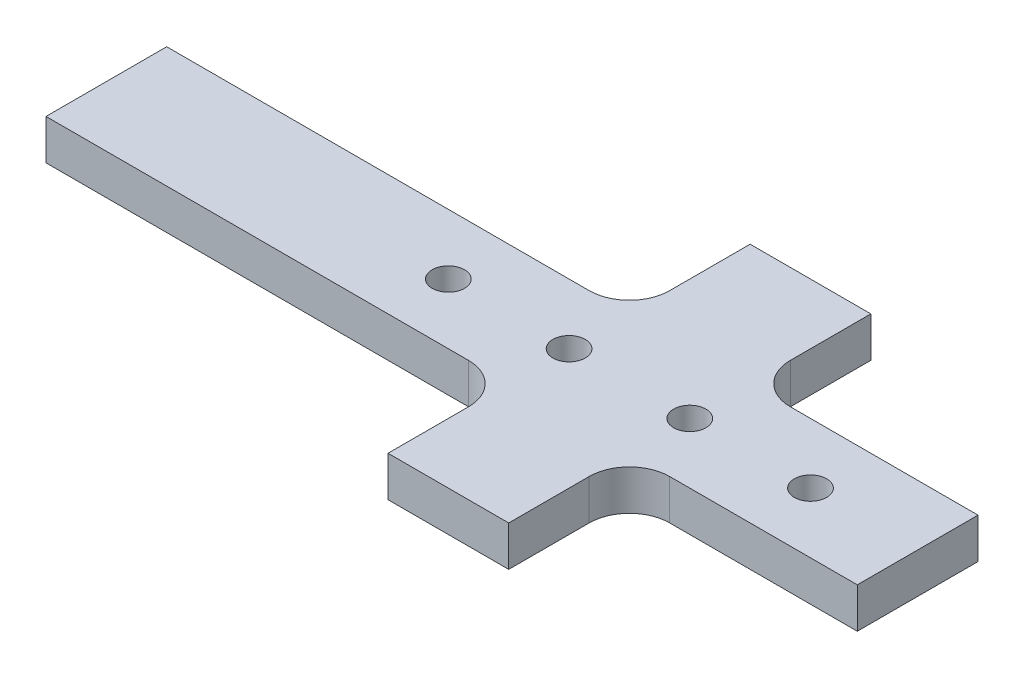
ISO-10303-21;
HEADER;
FILE_DESCRIPTION(('STEP AP214'),'2;1');
FILE_NAME('part.step','',(''),(''),'','','');
FILE_SCHEMA(('AUTOMOTIVE_DESIGN { 1 0 10303 214 1 1 1 1 }'));
ENDSEC;
DATA;
#1=APPLICATION_CONTEXT('core data for automotive mechanical design processes');
#2=APPLICATION_PROTOCOL_DEFINITION('international standard','automotive_design',2000,#1);
#3=PRODUCT_CONTEXT('',#1,'mechanical');
#4=PRODUCT('Part','Part','',(#3));
#5=PRODUCT_RELATED_PRODUCT_CATEGORY('part','',(#4));
#6=PRODUCT_DEFINITION_FORMATION('','',#4);
#7=PRODUCT_DEFINITION_CONTEXT('part definition',#1,'design');
#8=PRODUCT_DEFINITION('design','',#6,#7);
#9=PRODUCT_DEFINITION_SHAPE('','',#8);
#10=(LENGTH_UNIT() NAMED_UNIT(*) SI_UNIT(.MILLI.,.METRE.));
#11=(NAMED_UNIT(*) PLANE_ANGLE_UNIT() SI_UNIT($,.RADIAN.));
#12=(NAMED_UNIT(*) SI_UNIT($,.STERADIAN.) SOLID_ANGLE_UNIT());
#13=UNCERTAINTY_MEASURE_WITH_UNIT(LENGTH_MEASURE(1.E-05),#10,'distance_accuracy_value','');
#14=(GEOMETRIC_REPRESENTATION_CONTEXT(3) GLOBAL_UNCERTAINTY_ASSIGNED_CONTEXT((#13)) GLOBAL_UNIT_ASSIGNED_CONTEXT((#10,
#11,#12)) REPRESENTATION_CONTEXT('',''));
#15=CARTESIAN_POINT('',(0.,0.,0.));
#16=DIRECTION('',(0.,0.,1.));
#17=DIRECTION('',(1.,0.,0.));
#18=AXIS2_PLACEMENT_3D('',#15,#16,#17);
#19=CARTESIAN_POINT('',(28.575,0.,0.));
#20=DIRECTION('',(0.,-1.,0.));
#21=DIRECTION('',(0.,0.,-1.));
#22=AXIS2_PLACEMENT_3D('',#19,#20,#21);
#23=CYLINDRICAL_SURFACE('',#22,2.55269999999999);
#24=CARTESIAN_POINT('',(28.575,6.34999999999999,0.));
#25=DIRECTION('',(0.,-1.,0.));
#26=DIRECTION('',(0.,0.,-1.));
#27=AXIS2_PLACEMENT_3D('',#24,#25,#26);
#28=CIRCLE('',#27,2.55269999999999);
#29=CARTESIAN_POINT('',(28.575,6.34999999999999,-2.55269999999999));
#30=VERTEX_POINT('',#29);
#31=EDGE_CURVE('E43',#30,#30,#28,.T.);
#32=ORIENTED_EDGE('',*,*,#31,.F.);
#33=EDGE_LOOP('',(#32));
#34=FACE_BOUND('',#33,.T.);
#35=CARTESIAN_POINT('',(28.575,0.,0.));
#36=DIRECTION('',(0.,-1.,0.));
#37=DIRECTION('',(0.,0.,-1.));
#38=AXIS2_PLACEMENT_3D('',#35,#36,#37);
#39=CIRCLE('',#38,2.55269999999999);
#40=CARTESIAN_POINT('',(28.575,0.,-2.55269999999999));
#41=VERTEX_POINT('',#40);
#42=EDGE_CURVE('E11',#41,#41,#39,.T.);
#43=ORIENTED_EDGE('',*,*,#42,.T.);
#44=EDGE_LOOP('',(#43));
#45=FACE_BOUND('',#44,.T.);
#46=ADVANCED_FACE('F35',(#34,#45),#23,.F.);
#47=CARTESIAN_POINT('',(9.525,0.,0.));
#48=DIRECTION('',(0.,-1.,0.));
#49=DIRECTION('',(0.,0.,-1.));
#50=AXIS2_PLACEMENT_3D('',#47,#48,#49);
#51=CYLINDRICAL_SURFACE('',#50,2.55269999999999);
#52=CARTESIAN_POINT('',(9.525,6.34999999999999,0.));
#53=DIRECTION('',(0.,-1.,0.));
#54=DIRECTION('',(0.,0.,-1.));
#55=AXIS2_PLACEMENT_3D('',#52,#53,#54);
#56=CIRCLE('',#55,2.55269999999999);
#57=CARTESIAN_POINT('',(9.525,6.34999999999999,-2.55269999999999));
#58=VERTEX_POINT('',#57);
#59=EDGE_CURVE('E250',#58,#58,#56,.T.);
#60=ORIENTED_EDGE('',*,*,#59,.F.);
#61=EDGE_LOOP('',(#60));
#62=FACE_BOUND('',#61,.T.);
#63=CARTESIAN_POINT('',(9.525,0.,0.));
#64=DIRECTION('',(0.,-1.,0.));
#65=DIRECTION('',(0.,0.,-1.));
#66=AXIS2_PLACEMENT_3D('',#63,#64,#65);
#67=CIRCLE('',#66,2.55269999999999);
#68=CARTESIAN_POINT('',(9.525,0.,-2.55269999999999));
#69=VERTEX_POINT('',#68);
#70=EDGE_CURVE('E253',#69,#69,#67,.T.);
#71=ORIENTED_EDGE('',*,*,#70,.T.);
#72=EDGE_LOOP('',(#71));
#73=FACE_BOUND('',#72,.T.);
#74=ADVANCED_FACE('F261',(#62,#73),#51,.F.);
#75=CARTESIAN_POINT('',(-15.875,0.,-15.875));
#76=DIRECTION('',(0.,1.,0.));
#77=DIRECTION('',(0.,0.,1.));
#78=AXIS2_PLACEMENT_3D('',#75,#76,#77);
#79=PLANE('',#78);
#80=CARTESIAN_POINT('',(-9.525,0.,0.));
#81=DIRECTION('',(0.,-1.,0.));
#82=DIRECTION('',(0.,0.,-1.));
#83=AXIS2_PLACEMENT_3D('',#80,#81,#82);
#84=CIRCLE('',#83,2.55269999999999);
#85=CARTESIAN_POINT('',(-9.525,0.,-2.55269999999999));
#86=VERTEX_POINT('',#85);
#87=EDGE_CURVE('E386',#86,#86,#84,.T.);
#88=ORIENTED_EDGE('',*,*,#87,.F.);
#89=EDGE_LOOP('',(#88));
#90=FACE_BOUND('',#89,.T.);
#91=DIRECTION('',(1.,0.,0.));
#92=VECTOR('',#91,1.);
#93=CARTESIAN_POINT('',(-74.8269585302169,0.,9.525));
#94=LINE('',#93,#92);
#95=CARTESIAN_POINT('',(-82.55,0.,9.52499999999999));
#96=VERTEX_POINT('',#95);
#97=CARTESIAN_POINT('',(-15.875,0.,9.52499999999999));
#98=VERTEX_POINT('',#97);
#99=EDGE_CURVE('E110',#96,#98,#94,.T.);
#100=ORIENTED_EDGE('',*,*,#99,.F.);
#101=DIRECTION('',(0.,0.,1.));
#102=VECTOR('',#101,1.);
#103=CARTESIAN_POINT('',(-82.55,0.,9.52499999999999));
#104=LINE('',#103,#102);
#105=CARTESIAN_POINT('',(-82.55,0.,-9.52499999999996));
#106=VERTEX_POINT('',#105);
#107=EDGE_CURVE('E208',#106,#96,#104,.T.);
#108=ORIENTED_EDGE('',*,*,#107,.F.);
#109=DIRECTION('',(-1.,0.,0.));
#110=VECTOR('',#109,1.);
#111=CARTESIAN_POINT('',(-82.55,0.,-9.52499999999996));
#112=LINE('',#111,#110);
#113=CARTESIAN_POINT('',(-15.875,0.,-9.52499999999998));
#114=VERTEX_POINT('',#113);
#115=EDGE_CURVE('E103',#114,#106,#112,.T.);
#116=ORIENTED_EDGE('',*,*,#115,.F.);
#117=CARTESIAN_POINT('',(-15.875,0.,-15.875));
#118=DIRECTION('',(0.,-1.,0.));
#119=DIRECTION('',(0.,0.,1.));
#120=AXIS2_PLACEMENT_3D('',#117,#118,#119);
#121=CIRCLE('',#120,6.35);
#122=CARTESIAN_POINT('',(-9.525,0.,-15.875));
#123=VERTEX_POINT('',#122);
#124=EDGE_CURVE('E170',#123,#114,#121,.T.);
#125=ORIENTED_EDGE('',*,*,#124,.F.);
#126=DIRECTION('',(0.,0.,1.));
#127=VECTOR('',#126,1.);
#128=CARTESIAN_POINT('',(-9.525,0.,-28.575));
#129=LINE('',#128,#127);
#130=CARTESIAN_POINT('',(-9.525,0.,-28.575));
#131=VERTEX_POINT('',#130);
#132=EDGE_CURVE('E204',#131,#123,#129,.T.);
#133=ORIENTED_EDGE('',*,*,#132,.F.);
#134=DIRECTION('',(-1.,0.,0.));
#135=VECTOR('',#134,1.);
#136=CARTESIAN_POINT('',(9.525,0.,-28.575));
#137=LINE('',#136,#135);
#138=CARTESIAN_POINT('',(9.525,0.,-28.575));
#139=VERTEX_POINT('',#138);
#140=EDGE_CURVE('E202',#139,#131,#137,.T.);
#141=ORIENTED_EDGE('',*,*,#140,.F.);
#142=DIRECTION('',(0.,0.,-1.));
#143=VECTOR('',#142,1.);
#144=CARTESIAN_POINT('',(9.525,0.,-15.875));
#145=LINE('',#144,#143);
#146=CARTESIAN_POINT('',(9.525,0.,-15.875));
#147=VERTEX_POINT('',#146);
#148=EDGE_CURVE('E200',#147,#139,#145,.T.);
#149=ORIENTED_EDGE('',*,*,#148,.F.);
#150=CARTESIAN_POINT('',(15.875,0.,-15.875));
#151=DIRECTION('',(0.,-1.,0.));
#152=DIRECTION('',(0.,0.,1.));
#153=AXIS2_PLACEMENT_3D('',#150,#151,#152);
#154=CIRCLE('',#153,6.35);
#155=CARTESIAN_POINT('',(15.875,0.,-9.52499999999998));
#156=VERTEX_POINT('',#155);
#157=EDGE_CURVE('E198',#156,#147,#154,.T.);
#158=ORIENTED_EDGE('',*,*,#157,.F.);
#159=DIRECTION('',(-1.,0.,0.));
#160=VECTOR('',#159,1.);
#161=CARTESIAN_POINT('',(45.485511374016,0.,-9.52499999999998));
#162=LINE('',#161,#160);
#163=CARTESIAN_POINT('',(45.485511374016,0.,-9.52499999999998));
#164=VERTEX_POINT('',#163);
#165=EDGE_CURVE('E196',#164,#156,#162,.T.);
#166=ORIENTED_EDGE('',*,*,#165,.F.);
#167=DIRECTION('',(0.,0.,-1.));
#168=VECTOR('',#167,1.);
#169=CARTESIAN_POINT('',(45.485511374016,0.,9.52499999999998));
#170=LINE('',#169,#168);
#171=CARTESIAN_POINT('',(45.485511374016,0.,9.52499999999998));
#172=VERTEX_POINT('',#171);
#173=EDGE_CURVE('E194',#172,#164,#170,.T.);
#174=ORIENTED_EDGE('',*,*,#173,.F.);
#175=DIRECTION('',(1.,0.,0.));
#176=VECTOR('',#175,1.);
#177=CARTESIAN_POINT('',(15.875,0.,9.52499999999998));
#178=LINE('',#177,#176);
#179=CARTESIAN_POINT('',(15.875,0.,9.52499999999998));
#180=VERTEX_POINT('',#179);
#181=EDGE_CURVE('E192',#180,#172,#178,.T.);
#182=ORIENTED_EDGE('',*,*,#181,.F.);
#183=CARTESIAN_POINT('',(15.875,0.,15.875));
#184=DIRECTION('',(0.,-1.,0.));
#185=DIRECTION('',(0.,0.,1.));
#186=AXIS2_PLACEMENT_3D('',#183,#184,#185);
#187=CIRCLE('',#186,6.35);
#188=CARTESIAN_POINT('',(9.525,0.,15.875));
#189=VERTEX_POINT('',#188);
#190=EDGE_CURVE('E190',#189,#180,#187,.T.);
#191=ORIENTED_EDGE('',*,*,#190,.F.);
#192=DIRECTION('',(0.,0.,-1.));
#193=VECTOR('',#192,1.);
#194=CARTESIAN_POINT('',(9.525,0.,28.575));
#195=LINE('',#194,#193);
#196=CARTESIAN_POINT('',(9.525,0.,28.575));
#197=VERTEX_POINT('',#196);
#198=EDGE_CURVE('E188',#197,#189,#195,.T.);
#199=ORIENTED_EDGE('',*,*,#198,.F.);
#200=DIRECTION('',(1.,0.,0.));
#201=VECTOR('',#200,1.);
#202=CARTESIAN_POINT('',(-9.525,0.,28.575));
#203=LINE('',#202,#201);
#204=CARTESIAN_POINT('',(-9.525,0.,28.575));
#205=VERTEX_POINT('',#204);
#206=EDGE_CURVE('E186',#205,#197,#203,.T.);
#207=ORIENTED_EDGE('',*,*,#206,.F.);
#208=DIRECTION('',(0.,0.,1.));
#209=VECTOR('',#208,1.);
#210=CARTESIAN_POINT('',(-9.525,0.,15.875));
#211=LINE('',#210,#209);
#212=CARTESIAN_POINT('',(-9.525,0.,15.875));
#213=VERTEX_POINT('',#212);
#214=EDGE_CURVE('E184',#213,#205,#211,.T.);
#215=ORIENTED_EDGE('',*,*,#214,.F.);
#216=CARTESIAN_POINT('',(-15.875,0.,15.875));
#217=DIRECTION('',(0.,-1.,0.));
#218=DIRECTION('',(0.,0.,1.));
#219=AXIS2_PLACEMENT_3D('',#216,#217,#218);
#220=CIRCLE('',#219,6.35);
#221=EDGE_CURVE('E181',#98,#213,#220,.T.);
#222=ORIENTED_EDGE('',*,*,#221,.F.);
#223=EDGE_LOOP('',(#100,#108,#116,#125,#133,#141,#149,#158,#166,#174,#182,#191,#199,#207,#215,#222));
#224=FACE_BOUND('',#223,.T.);
#225=CARTESIAN_POINT('',(-28.575,0.,0.));
#226=DIRECTION('',(0.,-1.,0.));
#227=DIRECTION('',(0.,0.,-1.));
#228=AXIS2_PLACEMENT_3D('',#225,#226,#227);
#229=CIRCLE('',#228,2.55269999999999);
#230=CARTESIAN_POINT('',(-28.575,0.,-2.55269999999999));
#231=VERTEX_POINT('',#230);
#232=EDGE_CURVE('E383',#231,#231,#229,.T.);
#233=ORIENTED_EDGE('',*,*,#232,.F.);
#234=EDGE_LOOP('',(#233));
#235=FACE_BOUND('',#234,.T.);
#236=ORIENTED_EDGE('',*,*,#70,.F.);
#237=EDGE_LOOP('',(#236));
#238=FACE_BOUND('',#237,.T.);
#239=ORIENTED_EDGE('',*,*,#42,.F.);
#240=EDGE_LOOP('',(#239));
#241=FACE_BOUND('',#240,.T.);
#242=ADVANCED_FACE('F264',(#90,#224,#235,#238,#241),#79,.F.);
#243=CARTESIAN_POINT('',(-74.8269585302169,6.35,9.525));
#244=DIRECTION('',(0.,0.,-1.));
#245=DIRECTION('',(-1.,0.,0.));
#246=AXIS2_PLACEMENT_3D('',#243,#244,#245);
#247=PLANE('',#246);
#248=ORIENTED_EDGE('',*,*,#99,.T.);
#249=DIRECTION('',(0.,-1.,0.));
#250=VECTOR('',#249,1.);
#251=CARTESIAN_POINT('',(-15.875,6.35,9.52499999999999));
#252=LINE('',#251,#250);
#253=CARTESIAN_POINT('',(-15.875,6.35,9.52499999999999));
#254=VERTEX_POINT('',#253);
#255=EDGE_CURVE('E247',#254,#98,#252,.T.);
#256=ORIENTED_EDGE('',*,*,#255,.F.);
#257=DIRECTION('',(1.,0.,0.));
#258=VECTOR('',#257,1.);
#259=CARTESIAN_POINT('',(-74.8269585302169,6.35,9.525));
#260=LINE('',#259,#258);
#261=CARTESIAN_POINT('',(-82.55,6.35,9.52499999999999));
#262=VERTEX_POINT('',#261);
#263=EDGE_CURVE('E116',#262,#254,#260,.T.);
#264=ORIENTED_EDGE('',*,*,#263,.F.);
#265=DIRECTION('',(0.,-1.,0.));
#266=VECTOR('',#265,1.);
#267=CARTESIAN_POINT('',(-82.55,6.35,9.52499999999999));
#268=LINE('',#267,#266);
#269=EDGE_CURVE('E176',#262,#96,#268,.T.);
#270=ORIENTED_EDGE('',*,*,#269,.T.);
#271=EDGE_LOOP('',(#248,#256,#264,#270));
#272=FACE_BOUND('',#271,.T.);
#273=ADVANCED_FACE('F266',(#272),#247,.F.);
#274=CARTESIAN_POINT('',(-15.875,6.35,15.875));
#275=DIRECTION('',(0.,-1.,0.));
#276=DIRECTION('',(0.,0.,-1.));
#277=AXIS2_PLACEMENT_3D('',#274,#275,#276);
#278=CYLINDRICAL_SURFACE('',#277,6.35);
#279=ORIENTED_EDGE('',*,*,#221,.T.);
#280=DIRECTION('',(0.,-1.,0.));
#281=VECTOR('',#280,1.);
#282=CARTESIAN_POINT('',(-9.525,6.35,15.875));
#283=LINE('',#282,#281);
#284=CARTESIAN_POINT('',(-9.525,6.35,15.875));
#285=VERTEX_POINT('',#284);
#286=EDGE_CURVE('E244',#285,#213,#283,.T.);
#287=ORIENTED_EDGE('',*,*,#286,.F.);
#288=CARTESIAN_POINT('',(-15.875,6.35,15.875));
#289=DIRECTION('',(0.,-1.,0.));
#290=DIRECTION('',(0.,0.,1.));
#291=AXIS2_PLACEMENT_3D('',#288,#289,#290);
#292=CIRCLE('',#291,6.35);
#293=EDGE_CURVE('E377',#254,#285,#292,.T.);
#294=ORIENTED_EDGE('',*,*,#293,.F.);
#295=ORIENTED_EDGE('',*,*,#255,.T.);
#296=EDGE_LOOP('',(#279,#287,#294,#295));
#297=FACE_BOUND('',#296,.T.);
#298=ADVANCED_FACE('F273',(#297),#278,.F.);
#299=CARTESIAN_POINT('',(-9.525,6.35,15.875));
#300=DIRECTION('',(1.,0.,0.));
#301=DIRECTION('',(0.,0.,-1.));
#302=AXIS2_PLACEMENT_3D('',#299,#300,#301);
#303=PLANE('',#302);
#304=ORIENTED_EDGE('',*,*,#214,.T.);
#305=DIRECTION('',(0.,-1.,0.));
#306=VECTOR('',#305,1.);
#307=CARTESIAN_POINT('',(-9.525,6.35,28.575));
#308=LINE('',#307,#306);
#309=CARTESIAN_POINT('',(-9.525,6.35,28.575));
#310=VERTEX_POINT('',#309);
#311=EDGE_CURVE('E241',#310,#205,#308,.T.);
#312=ORIENTED_EDGE('',*,*,#311,.F.);
#313=DIRECTION('',(0.,0.,1.));
#314=VECTOR('',#313,1.);
#315=CARTESIAN_POINT('',(-9.525,6.35,15.875));
#316=LINE('',#315,#314);
#317=EDGE_CURVE('E342',#285,#310,#316,.T.);
#318=ORIENTED_EDGE('',*,*,#317,.F.);
#319=ORIENTED_EDGE('',*,*,#286,.T.);
#320=EDGE_LOOP('',(#304,#312,#318,#319));
#321=FACE_BOUND('',#320,.T.);
#322=ADVANCED_FACE('F328',(#321),#303,.F.);
#323=CARTESIAN_POINT('',(-9.525,6.35,28.575));
#324=DIRECTION('',(0.,0.,-1.));
#325=DIRECTION('',(-1.,0.,0.));
#326=AXIS2_PLACEMENT_3D('',#323,#324,#325);
#327=PLANE('',#326);
#328=ORIENTED_EDGE('',*,*,#206,.T.);
#329=DIRECTION('',(0.,-1.,0.));
#330=VECTOR('',#329,1.);
#331=CARTESIAN_POINT('',(9.525,6.35,28.575));
#332=LINE('',#331,#330);
#333=CARTESIAN_POINT('',(9.525,6.35,28.575));
#334=VERTEX_POINT('',#333);
#335=EDGE_CURVE('E238',#334,#197,#332,.T.);
#336=ORIENTED_EDGE('',*,*,#335,.F.);
#337=DIRECTION('',(1.,0.,0.));
#338=VECTOR('',#337,1.);
#339=CARTESIAN_POINT('',(-9.525,6.35,28.575));
#340=LINE('',#339,#338);
#341=EDGE_CURVE('E354',#310,#334,#340,.T.);
#342=ORIENTED_EDGE('',*,*,#341,.F.);
#343=ORIENTED_EDGE('',*,*,#311,.T.);
#344=EDGE_LOOP('',(#328,#336,#342,#343));
#345=FACE_BOUND('',#344,.T.);
#346=ADVANCED_FACE('F324',(#345),#327,.F.);
#347=CARTESIAN_POINT('',(9.525,6.35,28.575));
#348=DIRECTION('',(-1.,0.,0.));
#349=DIRECTION('',(0.,0.,1.));
#350=AXIS2_PLACEMENT_3D('',#347,#348,#349);
#351=PLANE('',#350);
#352=ORIENTED_EDGE('',*,*,#198,.T.);
#353=DIRECTION('',(0.,-1.,0.));
#354=VECTOR('',#353,1.);
#355=CARTESIAN_POINT('',(9.525,6.35,15.875));
#356=LINE('',#355,#354);
#357=CARTESIAN_POINT('',(9.525,6.35,15.875));
#358=VERTEX_POINT('',#357);
#359=EDGE_CURVE('E235',#358,#189,#356,.T.);
#360=ORIENTED_EDGE('',*,*,#359,.F.);
#361=DIRECTION('',(0.,0.,-1.));
#362=VECTOR('',#361,1.);
#363=CARTESIAN_POINT('',(9.525,6.35,28.575));
#364=LINE('',#363,#362);
#365=EDGE_CURVE('E351',#334,#358,#364,.T.);
#366=ORIENTED_EDGE('',*,*,#365,.F.);
#367=ORIENTED_EDGE('',*,*,#335,.T.);
#368=EDGE_LOOP('',(#352,#360,#366,#367));
#369=FACE_BOUND('',#368,.T.);
#370=ADVANCED_FACE('F320',(#369),#351,.F.);
#371=CARTESIAN_POINT('',(15.875,6.35,15.875));
#372=DIRECTION('',(0.,-1.,0.));
#373=DIRECTION('',(0.,0.,-1.));
#374=AXIS2_PLACEMENT_3D('',#371,#372,#373);
#375=CYLINDRICAL_SURFACE('',#374,6.35);
#376=ORIENTED_EDGE('',*,*,#190,.T.);
#377=DIRECTION('',(0.,-1.,0.));
#378=VECTOR('',#377,1.);
#379=CARTESIAN_POINT('',(15.875,6.35,9.52499999999998));
#380=LINE('',#379,#378);
#381=CARTESIAN_POINT('',(15.875,6.35,9.52499999999998));
#382=VERTEX_POINT('',#381);
#383=EDGE_CURVE('E232',#382,#180,#380,.T.);
#384=ORIENTED_EDGE('',*,*,#383,.F.);
#385=CARTESIAN_POINT('',(15.875,6.35,15.875));
#386=DIRECTION('',(0.,-1.,0.));
#387=DIRECTION('',(0.,0.,1.));
#388=AXIS2_PLACEMENT_3D('',#385,#386,#387);
#389=CIRCLE('',#388,6.35);
#390=EDGE_CURVE('E353',#358,#382,#389,.T.);
#391=ORIENTED_EDGE('',*,*,#390,.F.);
#392=ORIENTED_EDGE('',*,*,#359,.T.);
#393=EDGE_LOOP('',(#376,#384,#391,#392));
#394=FACE_BOUND('',#393,.T.);
#395=ADVANCED_FACE('F316',(#394),#375,.F.);
#396=CARTESIAN_POINT('',(15.875,6.35,9.52499999999998));
#397=DIRECTION('',(0.,0.,-1.));
#398=DIRECTION('',(-1.,0.,0.));
#399=AXIS2_PLACEMENT_3D('',#396,#397,#398);
#400=PLANE('',#399);
#401=ORIENTED_EDGE('',*,*,#181,.T.);
#402=DIRECTION('',(0.,-1.,0.));
#403=VECTOR('',#402,1.);
#404=CARTESIAN_POINT('',(45.485511374016,6.35,9.52499999999998));
#405=LINE('',#404,#403);
#406=CARTESIAN_POINT('',(45.485511374016,6.35,9.52499999999998));
#407=VERTEX_POINT('',#406);
#408=EDGE_CURVE('E229',#407,#172,#405,.T.);
#409=ORIENTED_EDGE('',*,*,#408,.F.);
#410=DIRECTION('',(1.,0.,0.));
#411=VECTOR('',#410,1.);
#412=CARTESIAN_POINT('',(15.875,6.35,9.52499999999998));
#413=LINE('',#412,#411);
#414=EDGE_CURVE('E356',#382,#407,#413,.T.);
#415=ORIENTED_EDGE('',*,*,#414,.F.);
#416=ORIENTED_EDGE('',*,*,#383,.T.);
#417=EDGE_LOOP('',(#401,#409,#415,#416));
#418=FACE_BOUND('',#417,.T.);
#419=ADVANCED_FACE('F312',(#418),#400,.F.);
#420=CARTESIAN_POINT('',(45.485511374016,6.35,9.52499999999998));
#421=DIRECTION('',(-1.,0.,0.));
#422=DIRECTION('',(0.,0.,1.));
#423=AXIS2_PLACEMENT_3D('',#420,#421,#422);
#424=PLANE('',#423);
#425=ORIENTED_EDGE('',*,*,#173,.T.);
#426=DIRECTION('',(0.,-1.,0.));
#427=VECTOR('',#426,1.);
#428=CARTESIAN_POINT('',(45.485511374016,6.35,-9.52499999999998));
#429=LINE('',#428,#427);
#430=CARTESIAN_POINT('',(45.485511374016,6.35,-9.52499999999998));
#431=VERTEX_POINT('',#430);
#432=EDGE_CURVE('E226',#431,#164,#429,.T.);
#433=ORIENTED_EDGE('',*,*,#432,.F.);
#434=DIRECTION('',(0.,0.,-1.));
#435=VECTOR('',#434,1.);
#436=CARTESIAN_POINT('',(45.485511374016,6.35,9.52499999999998));
#437=LINE('',#436,#435);
#438=EDGE_CURVE('E362',#407,#431,#437,.T.);
#439=ORIENTED_EDGE('',*,*,#438,.F.);
#440=ORIENTED_EDGE('',*,*,#408,.T.);
#441=EDGE_LOOP('',(#425,#433,#439,#440));
#442=FACE_BOUND('',#441,.T.);
#443=ADVANCED_FACE('F308',(#442),#424,.F.);
#444=CARTESIAN_POINT('',(45.485511374016,6.35,-9.52499999999998));
#445=DIRECTION('',(0.,0.,1.));
#446=DIRECTION('',(1.,0.,0.));
#447=AXIS2_PLACEMENT_3D('',#444,#445,#446);
#448=PLANE('',#447);
#449=ORIENTED_EDGE('',*,*,#165,.T.);
#450=DIRECTION('',(0.,-1.,0.));
#451=VECTOR('',#450,1.);
#452=CARTESIAN_POINT('',(15.875,6.35,-9.52499999999998));
#453=LINE('',#452,#451);
#454=CARTESIAN_POINT('',(15.875,6.35,-9.52499999999998));
#455=VERTEX_POINT('',#454);
#456=EDGE_CURVE('E223',#455,#156,#453,.T.);
#457=ORIENTED_EDGE('',*,*,#456,.F.);
#458=DIRECTION('',(-1.,0.,0.));
#459=VECTOR('',#458,1.);
#460=CARTESIAN_POINT('',(45.485511374016,6.35,-9.52499999999998));
#461=LINE('',#460,#459);
#462=EDGE_CURVE('E364',#431,#455,#461,.T.);
#463=ORIENTED_EDGE('',*,*,#462,.F.);
#464=ORIENTED_EDGE('',*,*,#432,.T.);
#465=EDGE_LOOP('',(#449,#457,#463,#464));
#466=FACE_BOUND('',#465,.T.);
#467=ADVANCED_FACE('F304',(#466),#448,.F.);
#468=CARTESIAN_POINT('',(15.875,6.35,-15.875));
#469=DIRECTION('',(0.,-1.,0.));
#470=DIRECTION('',(0.,0.,-1.));
#471=AXIS2_PLACEMENT_3D('',#468,#469,#470);
#472=CYLINDRICAL_SURFACE('',#471,6.35);
#473=ORIENTED_EDGE('',*,*,#157,.T.);
#474=DIRECTION('',(0.,-1.,0.));
#475=VECTOR('',#474,1.);
#476=CARTESIAN_POINT('',(9.525,6.35,-15.875));
#477=LINE('',#476,#475);
#478=CARTESIAN_POINT('',(9.525,6.35,-15.875));
#479=VERTEX_POINT('',#478);
#480=EDGE_CURVE('E220',#479,#147,#477,.T.);
#481=ORIENTED_EDGE('',*,*,#480,.F.);
#482=CARTESIAN_POINT('',(15.875,6.35,-15.875));
#483=DIRECTION('',(0.,-1.,0.));
#484=DIRECTION('',(0.,0.,1.));
#485=AXIS2_PLACEMENT_3D('',#482,#483,#484);
#486=CIRCLE('',#485,6.35);
#487=EDGE_CURVE('E366',#455,#479,#486,.T.);
#488=ORIENTED_EDGE('',*,*,#487,.F.);
#489=ORIENTED_EDGE('',*,*,#456,.T.);
#490=EDGE_LOOP('',(#473,#481,#488,#489));
#491=FACE_BOUND('',#490,.T.);
#492=ADVANCED_FACE('F300',(#491),#472,.F.);
#493=CARTESIAN_POINT('',(9.525,6.35,-15.875));
#494=DIRECTION('',(-1.,0.,0.));
#495=DIRECTION('',(0.,0.,1.));
#496=AXIS2_PLACEMENT_3D('',#493,#494,#495);
#497=PLANE('',#496);
#498=ORIENTED_EDGE('',*,*,#148,.T.);
#499=DIRECTION('',(0.,-1.,0.));
#500=VECTOR('',#499,1.);
#501=CARTESIAN_POINT('',(9.525,6.35,-28.575));
#502=LINE('',#501,#500);
#503=CARTESIAN_POINT('',(9.525,6.35,-28.575));
#504=VERTEX_POINT('',#503);
#505=EDGE_CURVE('E217',#504,#139,#502,.T.);
#506=ORIENTED_EDGE('',*,*,#505,.F.);
#507=DIRECTION('',(0.,0.,-1.));
#508=VECTOR('',#507,1.);
#509=CARTESIAN_POINT('',(9.525,6.35,-15.875));
#510=LINE('',#509,#508);
#511=EDGE_CURVE('E368',#479,#504,#510,.T.);
#512=ORIENTED_EDGE('',*,*,#511,.F.);
#513=ORIENTED_EDGE('',*,*,#480,.T.);
#514=EDGE_LOOP('',(#498,#506,#512,#513));
#515=FACE_BOUND('',#514,.T.);
#516=ADVANCED_FACE('F296',(#515),#497,.F.);
#517=CARTESIAN_POINT('',(9.525,6.35,-28.575));
#518=DIRECTION('',(0.,0.,1.));
#519=DIRECTION('',(1.,0.,0.));
#520=AXIS2_PLACEMENT_3D('',#517,#518,#519);
#521=PLANE('',#520);
#522=ORIENTED_EDGE('',*,*,#140,.T.);
#523=DIRECTION('',(0.,-1.,0.));
#524=VECTOR('',#523,1.);
#525=CARTESIAN_POINT('',(-9.525,6.35,-28.575));
#526=LINE('',#525,#524);
#527=CARTESIAN_POINT('',(-9.525,6.35,-28.575));
#528=VERTEX_POINT('',#527);
#529=EDGE_CURVE('E214',#528,#131,#526,.T.);
#530=ORIENTED_EDGE('',*,*,#529,.F.);
#531=DIRECTION('',(-1.,0.,0.));
#532=VECTOR('',#531,1.);
#533=CARTESIAN_POINT('',(9.525,6.35,-28.575));
#534=LINE('',#533,#532);
#535=EDGE_CURVE('E370',#504,#528,#534,.T.);
#536=ORIENTED_EDGE('',*,*,#535,.F.);
#537=ORIENTED_EDGE('',*,*,#505,.T.);
#538=EDGE_LOOP('',(#522,#530,#536,#537));
#539=FACE_BOUND('',#538,.T.);
#540=ADVANCED_FACE('F292',(#539),#521,.F.);
#541=CARTESIAN_POINT('',(-9.525,6.35,-28.575));
#542=DIRECTION('',(1.,0.,0.));
#543=DIRECTION('',(0.,0.,-1.));
#544=AXIS2_PLACEMENT_3D('',#541,#542,#543);
#545=PLANE('',#544);
#546=ORIENTED_EDGE('',*,*,#132,.T.);
#547=DIRECTION('',(0.,-1.,0.));
#548=VECTOR('',#547,1.);
#549=CARTESIAN_POINT('',(-9.525,6.35,-15.875));
#550=LINE('',#549,#548);
#551=CARTESIAN_POINT('',(-9.525,6.35,-15.875));
#552=VERTEX_POINT('',#551);
#553=EDGE_CURVE('E171',#552,#123,#550,.T.);
#554=ORIENTED_EDGE('',*,*,#553,.F.);
#555=DIRECTION('',(0.,0.,1.));
#556=VECTOR('',#555,1.);
#557=CARTESIAN_POINT('',(-9.525,6.35,-28.575));
#558=LINE('',#557,#556);
#559=EDGE_CURVE('E161',#528,#552,#558,.T.);
#560=ORIENTED_EDGE('',*,*,#559,.F.);
#561=ORIENTED_EDGE('',*,*,#529,.T.);
#562=EDGE_LOOP('',(#546,#554,#560,#561));
#563=FACE_BOUND('',#562,.T.);
#564=ADVANCED_FACE('F289',(#563),#545,.F.);
#565=CARTESIAN_POINT('',(-15.875,6.35,-15.875));
#566=DIRECTION('',(0.,-1.,0.));
#567=DIRECTION('',(0.,0.,-1.));
#568=AXIS2_PLACEMENT_3D('',#565,#566,#567);
#569=CYLINDRICAL_SURFACE('',#568,6.35);
#570=ORIENTED_EDGE('',*,*,#124,.T.);
#571=DIRECTION('',(0.,-1.,0.));
#572=VECTOR('',#571,1.);
#573=CARTESIAN_POINT('',(-15.875,6.35,-9.52499999999998));
#574=LINE('',#573,#572);
#575=CARTESIAN_POINT('',(-15.875,6.35,-9.52499999999998));
#576=VERTEX_POINT('',#575);
#577=EDGE_CURVE('E167',#576,#114,#574,.T.);
#578=ORIENTED_EDGE('',*,*,#577,.F.);
#579=CARTESIAN_POINT('',(-15.875,6.35,-15.875));
#580=DIRECTION('',(0.,-1.,0.));
#581=DIRECTION('',(0.,0.,1.));
#582=AXIS2_PLACEMENT_3D('',#579,#580,#581);
#583=CIRCLE('',#582,6.35);
#584=EDGE_CURVE('E154',#552,#576,#583,.T.);
#585=ORIENTED_EDGE('',*,*,#584,.F.);
#586=ORIENTED_EDGE('',*,*,#553,.T.);
#587=EDGE_LOOP('',(#570,#578,#585,#586));
#588=FACE_BOUND('',#587,.T.);
#589=ADVANCED_FACE('F168',(#588),#569,.F.);
#590=CARTESIAN_POINT('',(-82.55,6.35,-9.52499999999996));
#591=DIRECTION('',(0.,0.,1.));
#592=DIRECTION('',(1.,0.,0.));
#593=AXIS2_PLACEMENT_3D('',#590,#591,#592);
#594=PLANE('',#593);
#595=ORIENTED_EDGE('',*,*,#115,.T.);
#596=DIRECTION('',(0.,-1.,0.));
#597=VECTOR('',#596,1.);
#598=CARTESIAN_POINT('',(-82.55,6.35,-9.52499999999996));
#599=LINE('',#598,#597);
#600=CARTESIAN_POINT('',(-82.55,6.35,-9.52499999999996));
#601=VERTEX_POINT('',#600);
#602=EDGE_CURVE('E172',#601,#106,#599,.T.);
#603=ORIENTED_EDGE('',*,*,#602,.F.);
#604=DIRECTION('',(-1.,0.,0.));
#605=VECTOR('',#604,1.);
#606=CARTESIAN_POINT('',(-15.875,6.35,-9.52499999999998));
#607=LINE('',#606,#605);
#608=EDGE_CURVE('E159',#576,#601,#607,.T.);
#609=ORIENTED_EDGE('',*,*,#608,.F.);
#610=ORIENTED_EDGE('',*,*,#577,.T.);
#611=EDGE_LOOP('',(#595,#603,#609,#610));
#612=FACE_BOUND('',#611,.T.);
#613=ADVANCED_FACE('F174',(#612),#594,.F.);
#614=CARTESIAN_POINT('',(-82.55,6.35,9.52499999999999));
#615=DIRECTION('',(1.,0.,0.));
#616=DIRECTION('',(0.,0.,-1.));
#617=AXIS2_PLACEMENT_3D('',#614,#615,#616);
#618=PLANE('',#617);
#619=ORIENTED_EDGE('',*,*,#107,.T.);
#620=ORIENTED_EDGE('',*,*,#269,.F.);
#621=DIRECTION('',(0.,0.,1.));
#622=VECTOR('',#621,1.);
#623=CARTESIAN_POINT('',(-82.55,6.35,9.52499999999999));
#624=LINE('',#623,#622);
#625=EDGE_CURVE('E51',#601,#262,#624,.T.);
#626=ORIENTED_EDGE('',*,*,#625,.F.);
#627=ORIENTED_EDGE('',*,*,#602,.T.);
#628=EDGE_LOOP('',(#619,#620,#626,#627));
#629=FACE_BOUND('',#628,.T.);
#630=ADVANCED_FACE('F281',(#629),#618,.F.);
#631=CARTESIAN_POINT('',(-15.875,6.35,-15.875));
#632=DIRECTION('',(0.,1.,0.));
#633=DIRECTION('',(0.,0.,1.));
#634=AXIS2_PLACEMENT_3D('',#631,#632,#633);
#635=PLANE('',#634);
#636=CARTESIAN_POINT('',(-9.525,6.34999999999999,0.));
#637=DIRECTION('',(0.,-1.,0.));
#638=DIRECTION('',(0.,0.,-1.));
#639=AXIS2_PLACEMENT_3D('',#636,#637,#638);
#640=CIRCLE('',#639,2.55269999999999);
#641=CARTESIAN_POINT('',(-9.525,6.34999999999999,-2.55269999999999));
#642=VERTEX_POINT('',#641);
#643=EDGE_CURVE('E389',#642,#642,#640,.T.);
#644=ORIENTED_EDGE('',*,*,#643,.T.);
#645=EDGE_LOOP('',(#644));
#646=FACE_BOUND('',#645,.T.);
#647=CARTESIAN_POINT('',(-28.575,6.34999999999999,0.));
#648=DIRECTION('',(0.,-1.,0.));
#649=DIRECTION('',(0.,0.,-1.));
#650=AXIS2_PLACEMENT_3D('',#647,#648,#649);
#651=CIRCLE('',#650,2.55269999999999);
#652=CARTESIAN_POINT('',(-28.575,6.34999999999999,-2.55269999999999));
#653=VERTEX_POINT('',#652);
#654=EDGE_CURVE('E182',#653,#653,#651,.T.);
#655=ORIENTED_EDGE('',*,*,#654,.T.);
#656=EDGE_LOOP('',(#655));
#657=FACE_BOUND('',#656,.T.);
#658=ORIENTED_EDGE('',*,*,#263,.T.);
#659=ORIENTED_EDGE('',*,*,#293,.T.);
#660=ORIENTED_EDGE('',*,*,#317,.T.);
#661=ORIENTED_EDGE('',*,*,#341,.T.);
#662=ORIENTED_EDGE('',*,*,#365,.T.);
#663=ORIENTED_EDGE('',*,*,#390,.T.);
#664=ORIENTED_EDGE('',*,*,#414,.T.);
#665=ORIENTED_EDGE('',*,*,#438,.T.);
#666=ORIENTED_EDGE('',*,*,#462,.T.);
#667=ORIENTED_EDGE('',*,*,#487,.T.);
#668=ORIENTED_EDGE('',*,*,#511,.T.);
#669=ORIENTED_EDGE('',*,*,#535,.T.);
#670=ORIENTED_EDGE('',*,*,#559,.T.);
#671=ORIENTED_EDGE('',*,*,#584,.T.);
#672=ORIENTED_EDGE('',*,*,#608,.T.);
#673=ORIENTED_EDGE('',*,*,#625,.T.);
#674=EDGE_LOOP('',(#658,#659,#660,#661,#662,#663,#664,#665,#666,#667,#668,#669,#670,#671,#672,#673));
#675=FACE_BOUND('',#674,.T.);
#676=ORIENTED_EDGE('',*,*,#59,.T.);
#677=EDGE_LOOP('',(#676));
#678=FACE_BOUND('',#677,.T.);
#679=ORIENTED_EDGE('',*,*,#31,.T.);
#680=EDGE_LOOP('',(#679));
#681=FACE_BOUND('',#680,.T.);
#682=ADVANCED_FACE('F156',(#646,#657,#675,#678,#681),#635,.T.);
#683=CARTESIAN_POINT('',(-28.575,0.,0.));
#684=DIRECTION('',(0.,-1.,0.));
#685=DIRECTION('',(0.,0.,-1.));
#686=AXIS2_PLACEMENT_3D('',#683,#684,#685);
#687=CYLINDRICAL_SURFACE('',#686,2.55269999999999);
#688=ORIENTED_EDGE('',*,*,#654,.F.);
#689=EDGE_LOOP('',(#688));
#690=FACE_BOUND('',#689,.T.);
#691=ORIENTED_EDGE('',*,*,#232,.T.);
#692=EDGE_LOOP('',(#691));
#693=FACE_BOUND('',#692,.T.);
#694=ADVANCED_FACE('F398',(#690,#693),#687,.F.);
#695=CARTESIAN_POINT('',(-9.525,0.,0.));
#696=DIRECTION('',(0.,-1.,0.));
#697=DIRECTION('',(0.,0.,-1.));
#698=AXIS2_PLACEMENT_3D('',#695,#696,#697);
#699=CYLINDRICAL_SURFACE('',#698,2.55269999999999);
#700=ORIENTED_EDGE('',*,*,#643,.F.);
#701=EDGE_LOOP('',(#700));
#702=FACE_BOUND('',#701,.T.);
#703=ORIENTED_EDGE('',*,*,#87,.T.);
#704=EDGE_LOOP('',(#703));
#705=FACE_BOUND('',#704,.T.);
#706=ADVANCED_FACE('F395',(#702,#705),#699,.F.);
#707=CLOSED_SHELL('',(#46,#74,#242,#273,#298,#322,#346,#370,#395,#419,#443,#467,#492,#516,#540,
#564,#589,#613,#630,#682,#694,#706));
#708=MANIFOLD_SOLID_BREP('B2',#707);
#709=ADVANCED_BREP_SHAPE_REPRESENTATION('',(#18,#708),#14);
#710=SHAPE_DEFINITION_REPRESENTATION(#9,#709);
ENDSEC;
END-ISO-10303-21;
